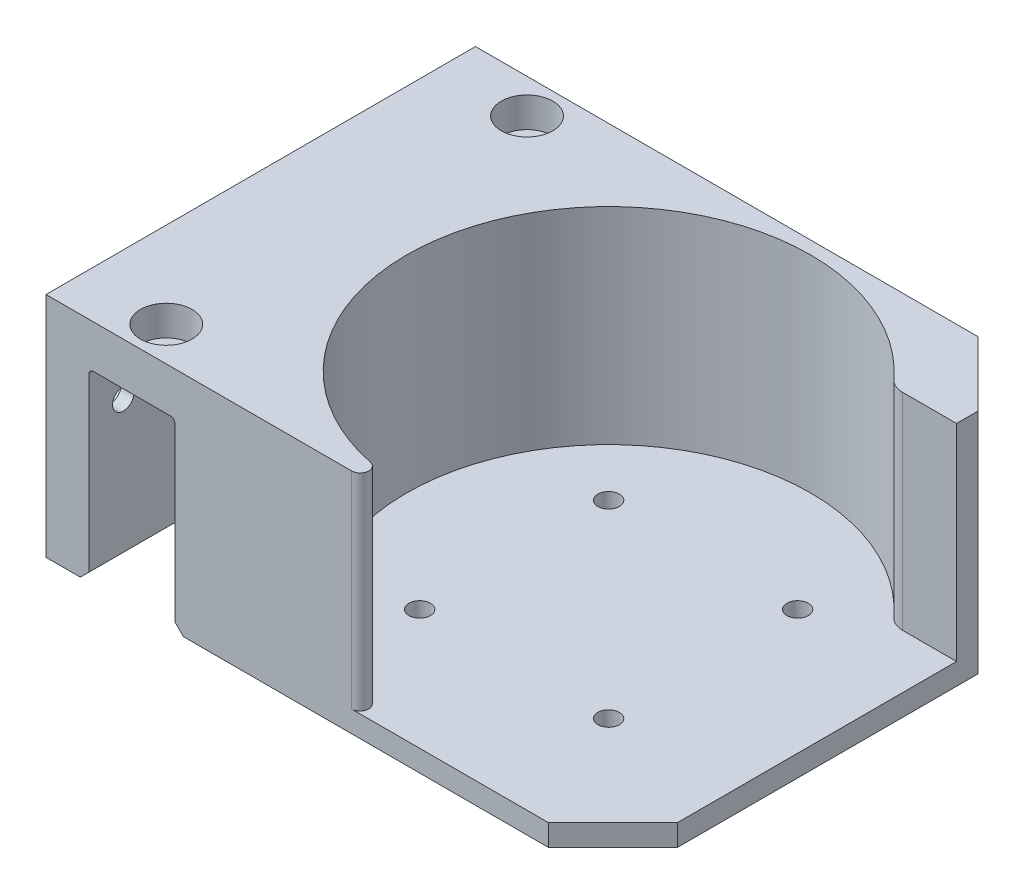
ISO-10303-21;
HEADER;
FILE_DESCRIPTION(('STEP AP214'),'2;1');
FILE_NAME('part.step','',(''),(''),'','','');
FILE_SCHEMA(('AUTOMOTIVE_DESIGN { 1 0 10303 214 1 1 1 1 }'));
ENDSEC;
DATA;
#1=APPLICATION_CONTEXT('core data for automotive mechanical design processes');
#2=APPLICATION_PROTOCOL_DEFINITION('international standard','automotive_design',2000,#1);
#3=PRODUCT_CONTEXT('',#1,'mechanical');
#4=PRODUCT('Part','Part','',(#3));
#5=PRODUCT_RELATED_PRODUCT_CATEGORY('part','',(#4));
#6=PRODUCT_DEFINITION_FORMATION('','',#4);
#7=PRODUCT_DEFINITION_CONTEXT('part definition',#1,'design');
#8=PRODUCT_DEFINITION('design','',#6,#7);
#9=PRODUCT_DEFINITION_SHAPE('','',#8);
#10=(LENGTH_UNIT() NAMED_UNIT(*) SI_UNIT(.MILLI.,.METRE.));
#11=(NAMED_UNIT(*) PLANE_ANGLE_UNIT() SI_UNIT($,.RADIAN.));
#12=(NAMED_UNIT(*) SI_UNIT($,.STERADIAN.) SOLID_ANGLE_UNIT());
#13=UNCERTAINTY_MEASURE_WITH_UNIT(LENGTH_MEASURE(1.E-05),#10,'distance_accuracy_value','');
#14=(GEOMETRIC_REPRESENTATION_CONTEXT(3) GLOBAL_UNCERTAINTY_ASSIGNED_CONTEXT((#13)) GLOBAL_UNIT_ASSIGNED_CONTEXT((#10,
#11,#12)) REPRESENTATION_CONTEXT('',''));
#15=CARTESIAN_POINT('',(0.,0.,0.));
#16=DIRECTION('',(0.,0.,1.));
#17=DIRECTION('',(1.,0.,0.));
#18=AXIS2_PLACEMENT_3D('',#15,#16,#17);
#19=CARTESIAN_POINT('',(-101.,33.,-42.));
#20=DIRECTION('',(1.,0.,0.));
#21=DIRECTION('',(0.,0.,-1.));
#22=AXIS2_PLACEMENT_3D('',#19,#20,#21);
#23=CYLINDRICAL_SURFACE('',#22,2.5);
#24=CARTESIAN_POINT('',(-71.,33.,-42.));
#25=DIRECTION('',(1.,0.,0.));
#26=DIRECTION('',(0.,0.,-1.));
#27=AXIS2_PLACEMENT_3D('',#24,#25,#26);
#28=CIRCLE('',#27,2.5);
#29=CARTESIAN_POINT('',(-71.,33.,-44.5));
#30=VERTEX_POINT('',#29);
#31=EDGE_CURVE('E382',#30,#30,#28,.T.);
#32=ORIENTED_EDGE('',*,*,#31,.T.);
#33=EDGE_LOOP('',(#32));
#34=FACE_BOUND('',#33,.T.);
#35=CARTESIAN_POINT('',(-74.,33.,-42.));
#36=DIRECTION('',(-1.,0.,0.));
#37=DIRECTION('',(0.,0.,1.));
#38=AXIS2_PLACEMENT_3D('',#35,#36,#37);
#39=CIRCLE('',#38,2.5);
#40=CARTESIAN_POINT('',(-74.,33.,-39.5));
#41=VERTEX_POINT('',#40);
#42=EDGE_CURVE('E377',#41,#41,#39,.F.);
#43=ORIENTED_EDGE('',*,*,#42,.F.);
#44=EDGE_LOOP('',(#43));
#45=FACE_BOUND('',#44,.T.);
#46=ADVANCED_FACE('F39',(#34,#45),#23,.F.);
#47=CARTESIAN_POINT('',(-101.,33.,42.));
#48=DIRECTION('',(1.,0.,0.));
#49=DIRECTION('',(0.,0.,-1.));
#50=AXIS2_PLACEMENT_3D('',#47,#48,#49);
#51=CYLINDRICAL_SURFACE('',#50,2.5);
#52=CARTESIAN_POINT('',(-71.,33.,42.));
#53=DIRECTION('',(1.,0.,0.));
#54=DIRECTION('',(0.,0.,-1.));
#55=AXIS2_PLACEMENT_3D('',#52,#53,#54);
#56=CIRCLE('',#55,2.5);
#57=CARTESIAN_POINT('',(-71.,33.,39.5));
#58=VERTEX_POINT('',#57);
#59=EDGE_CURVE('E867',#58,#58,#56,.T.);
#60=ORIENTED_EDGE('',*,*,#59,.T.);
#61=EDGE_LOOP('',(#60));
#62=FACE_BOUND('',#61,.T.);
#63=CARTESIAN_POINT('',(-74.,33.,42.));
#64=DIRECTION('',(-1.,0.,0.));
#65=DIRECTION('',(0.,0.,1.));
#66=AXIS2_PLACEMENT_3D('',#63,#64,#65);
#67=CIRCLE('',#66,2.5);
#68=CARTESIAN_POINT('',(-74.,33.,44.5));
#69=VERTEX_POINT('',#68);
#70=EDGE_CURVE('E373',#69,#69,#67,.F.);
#71=ORIENTED_EDGE('',*,*,#70,.F.);
#72=EDGE_LOOP('',(#71));
#73=FACE_BOUND('',#72,.T.);
#74=ADVANCED_FACE('F504',(#62,#73),#51,.F.);
#75=CARTESIAN_POINT('',(-61.,73.,-42.));
#76=DIRECTION('',(0.,-1.,0.));
#77=DIRECTION('',(0.,0.,-1.));
#78=AXIS2_PLACEMENT_3D('',#75,#76,#77);
#79=CYLINDRICAL_SURFACE('',#78,2.5);
#80=CARTESIAN_POINT('',(-61.,43.,-42.));
#81=DIRECTION('',(0.,-1.,0.));
#82=DIRECTION('',(0.,0.,-1.));
#83=AXIS2_PLACEMENT_3D('',#80,#81,#82);
#84=CIRCLE('',#83,2.5);
#85=CARTESIAN_POINT('',(-61.,43.,-44.5));
#86=VERTEX_POINT('',#85);
#87=EDGE_CURVE('E372',#86,#86,#84,.T.);
#88=ORIENTED_EDGE('',*,*,#87,.T.);
#89=EDGE_LOOP('',(#88));
#90=FACE_BOUND('',#89,.T.);
#91=CARTESIAN_POINT('',(-61.,46.,-42.));
#92=DIRECTION('',(0.,1.,0.));
#93=DIRECTION('',(0.,0.,1.));
#94=AXIS2_PLACEMENT_3D('',#91,#92,#93);
#95=CIRCLE('',#94,2.5);
#96=CARTESIAN_POINT('',(-61.,46.,-39.5));
#97=VERTEX_POINT('',#96);
#98=EDGE_CURVE('E367',#97,#97,#95,.F.);
#99=ORIENTED_EDGE('',*,*,#98,.F.);
#100=EDGE_LOOP('',(#99));
#101=FACE_BOUND('',#100,.T.);
#102=ADVANCED_FACE('F510',(#90,#101),#79,.F.);
#103=CARTESIAN_POINT('',(-61.,73.,42.));
#104=DIRECTION('',(0.,-1.,0.));
#105=DIRECTION('',(0.,0.,-1.));
#106=AXIS2_PLACEMENT_3D('',#103,#104,#105);
#107=CYLINDRICAL_SURFACE('',#106,2.5);
#108=CARTESIAN_POINT('',(-61.,43.,42.));
#109=DIRECTION('',(0.,-1.,0.));
#110=DIRECTION('',(0.,0.,-1.));
#111=AXIS2_PLACEMENT_3D('',#108,#109,#110);
#112=CIRCLE('',#111,2.5);
#113=CARTESIAN_POINT('',(-61.,43.,39.5));
#114=VERTEX_POINT('',#113);
#115=EDGE_CURVE('E205',#114,#114,#112,.T.);
#116=ORIENTED_EDGE('',*,*,#115,.T.);
#117=EDGE_LOOP('',(#116));
#118=FACE_BOUND('',#117,.T.);
#119=CARTESIAN_POINT('',(-61.,46.,42.));
#120=DIRECTION('',(0.,1.,0.));
#121=DIRECTION('',(0.,0.,1.));
#122=AXIS2_PLACEMENT_3D('',#119,#120,#121);
#123=CIRCLE('',#122,2.5);
#124=CARTESIAN_POINT('',(-61.,46.,44.5));
#125=VERTEX_POINT('',#124);
#126=EDGE_CURVE('E363',#125,#125,#123,.F.);
#127=ORIENTED_EDGE('',*,*,#126,.F.);
#128=EDGE_LOOP('',(#127));
#129=FACE_BOUND('',#128,.T.);
#130=ADVANCED_FACE('F534',(#118,#129),#107,.F.);
#131=CARTESIAN_POINT('',(-81.,43.,-50.));
#132=DIRECTION('',(0.,1.,0.));
#133=DIRECTION('',(0.,0.,1.));
#134=AXIS2_PLACEMENT_3D('',#131,#132,#133);
#135=PLANE('',#134);
#136=ORIENTED_EDGE('',*,*,#115,.F.);
#137=EDGE_LOOP('',(#136));
#138=FACE_BOUND('',#137,.T.);
#139=ORIENTED_EDGE('',*,*,#87,.F.);
#140=EDGE_LOOP('',(#139));
#141=FACE_BOUND('',#140,.T.);
#142=DIRECTION('',(1.,0.,0.));
#143=VECTOR('',#142,1.);
#144=CARTESIAN_POINT('',(-81.,43.,50.));
#145=LINE('',#144,#143);
#146=CARTESIAN_POINT('',(-70.,43.,50.));
#147=VERTEX_POINT('',#146);
#148=CARTESIAN_POINT('',(-52.,43.,50.));
#149=VERTEX_POINT('',#148);
#150=EDGE_CURVE('E215',#147,#149,#145,.T.);
#151=ORIENTED_EDGE('',*,*,#150,.F.);
#152=DIRECTION('',(0.,0.,1.));
#153=VECTOR('',#152,1.);
#154=CARTESIAN_POINT('',(-70.,43.,-50.));
#155=LINE('',#154,#153);
#156=CARTESIAN_POINT('',(-70.,43.,-50.));
#157=VERTEX_POINT('',#156);
#158=EDGE_CURVE('E416',#147,#157,#155,.F.);
#159=ORIENTED_EDGE('',*,*,#158,.T.);
#160=DIRECTION('',(1.,0.,0.));
#161=VECTOR('',#160,1.);
#162=CARTESIAN_POINT('',(-81.,43.,-50.));
#163=LINE('',#162,#161);
#164=CARTESIAN_POINT('',(-52.,43.,-50.));
#165=VERTEX_POINT('',#164);
#166=EDGE_CURVE('E218',#157,#165,#163,.T.);
#167=ORIENTED_EDGE('',*,*,#166,.T.);
#168=DIRECTION('',(0.,0.,1.));
#169=VECTOR('',#168,1.);
#170=CARTESIAN_POINT('',(-52.,43.,50.));
#171=LINE('',#170,#169);
#172=EDGE_CURVE('E412',#165,#149,#171,.T.);
#173=ORIENTED_EDGE('',*,*,#172,.T.);
#174=EDGE_LOOP('',(#151,#159,#167,#173));
#175=FACE_BOUND('',#174,.T.);
#176=ADVANCED_FACE('F440',(#138,#141,#175),#135,.F.);
#177=CARTESIAN_POINT('',(-51.,53.,-50.));
#178=DIRECTION('',(1.,0.,0.));
#179=DIRECTION('',(0.,0.,-1.));
#180=AXIS2_PLACEMENT_3D('',#177,#178,#179);
#181=PLANE('',#180);
#182=DIRECTION('',(0.,-1.,0.));
#183=VECTOR('',#182,1.);
#184=CARTESIAN_POINT('',(-51.,53.,50.));
#185=LINE('',#184,#183);
#186=CARTESIAN_POINT('',(-51.,42.,50.));
#187=VERTEX_POINT('',#186);
#188=CARTESIAN_POINT('',(-51.,2.00000000000002,50.));
#189=VERTEX_POINT('',#188);
#190=EDGE_CURVE('E293',#187,#189,#185,.T.);
#191=ORIENTED_EDGE('',*,*,#190,.F.);
#192=DIRECTION('',(0.,0.,1.));
#193=VECTOR('',#192,1.);
#194=CARTESIAN_POINT('',(-51.,42.,-50.));
#195=LINE('',#194,#193);
#196=CARTESIAN_POINT('',(-51.,42.,-50.));
#197=VERTEX_POINT('',#196);
#198=EDGE_CURVE('E61',#187,#197,#195,.F.);
#199=ORIENTED_EDGE('',*,*,#198,.T.);
#200=DIRECTION('',(0.,-1.,0.));
#201=VECTOR('',#200,1.);
#202=CARTESIAN_POINT('',(-51.,53.,-50.));
#203=LINE('',#202,#201);
#204=CARTESIAN_POINT('',(-51.,2.00000000000002,-50.));
#205=VERTEX_POINT('',#204);
#206=EDGE_CURVE('E305',#197,#205,#203,.T.);
#207=ORIENTED_EDGE('',*,*,#206,.T.);
#208=DIRECTION('',(0.,0.,1.));
#209=VECTOR('',#208,1.);
#210=CARTESIAN_POINT('',(-51.,2.00000000000002,-50.));
#211=LINE('',#210,#209);
#212=EDGE_CURVE('E401',#205,#189,#211,.T.);
#213=ORIENTED_EDGE('',*,*,#212,.T.);
#214=EDGE_LOOP('',(#191,#199,#207,#213));
#215=FACE_BOUND('',#214,.T.);
#216=ADVANCED_FACE('F446',(#215),#181,.F.);
#217=CARTESIAN_POINT('',(51.,53.,-50.));
#218=DIRECTION('',(-1.,0.,0.));
#219=DIRECTION('',(0.,0.,1.));
#220=AXIS2_PLACEMENT_3D('',#217,#218,#219);
#221=PLANE('',#220);
#222=DIRECTION('',(0.,0.,-1.));
#223=VECTOR('',#222,1.);
#224=CARTESIAN_POINT('',(51.,5.,0.));
#225=LINE('',#224,#223);
#226=CARTESIAN_POINT('',(51.,5.,35.));
#227=VERTEX_POINT('',#226);
#228=CARTESIAN_POINT('',(51.,5.,-30.));
#229=VERTEX_POINT('',#228);
#230=EDGE_CURVE('E263',#227,#229,#225,.T.);
#231=ORIENTED_EDGE('',*,*,#230,.F.);
#232=DIRECTION('',(0.,-1.,0.));
#233=VECTOR('',#232,1.);
#234=CARTESIAN_POINT('',(51.,53.,35.));
#235=LINE('',#234,#233);
#236=CARTESIAN_POINT('',(51.,0.,35.));
#237=VERTEX_POINT('',#236);
#238=EDGE_CURVE('E311',#227,#237,#235,.T.);
#239=ORIENTED_EDGE('',*,*,#238,.T.);
#240=DIRECTION('',(0.,0.,-1.));
#241=VECTOR('',#240,1.);
#242=CARTESIAN_POINT('',(51.,0.,-50.));
#243=LINE('',#242,#241);
#244=CARTESIAN_POINT('',(51.,0.,-35.));
#245=VERTEX_POINT('',#244);
#246=EDGE_CURVE('E280',#237,#245,#243,.T.);
#247=ORIENTED_EDGE('',*,*,#246,.T.);
#248=DIRECTION('',(0.,1.,0.));
#249=VECTOR('',#248,1.);
#250=CARTESIAN_POINT('',(51.,53.,-35.));
#251=LINE('',#250,#249);
#252=CARTESIAN_POINT('',(51.,53.,-35.));
#253=VERTEX_POINT('',#252);
#254=EDGE_CURVE('E308',#245,#253,#251,.T.);
#255=ORIENTED_EDGE('',*,*,#254,.T.);
#256=DIRECTION('',(0.,0.,-1.));
#257=VECTOR('',#256,1.);
#258=CARTESIAN_POINT('',(51.,53.,-50.));
#259=LINE('',#258,#257);
#260=CARTESIAN_POINT('',(51.,53.,-30.));
#261=VERTEX_POINT('',#260);
#262=EDGE_CURVE('E281',#261,#253,#259,.T.);
#263=ORIENTED_EDGE('',*,*,#262,.F.);
#264=DIRECTION('',(0.,1.,0.));
#265=VECTOR('',#264,1.);
#266=CARTESIAN_POINT('',(51.,5.,-30.));
#267=LINE('',#266,#265);
#268=EDGE_CURVE('E271',#229,#261,#267,.T.);
#269=ORIENTED_EDGE('',*,*,#268,.F.);
#270=EDGE_LOOP('',(#231,#239,#247,#255,#263,#269));
#271=FACE_BOUND('',#270,.T.);
#272=ADVANCED_FACE('F479',(#271),#221,.F.);
#273=CARTESIAN_POINT('',(0.,53.,0.));
#274=DIRECTION('',(0.,1.,0.));
#275=DIRECTION('',(0.,0.,1.));
#276=AXIS2_PLACEMENT_3D('',#273,#274,#275);
#277=PLANE('',#276);
#278=CARTESIAN_POINT('',(-61.,53.,-42.));
#279=DIRECTION('',(0.,1.,0.));
#280=DIRECTION('',(0.,0.,1.));
#281=AXIS2_PLACEMENT_3D('',#278,#279,#280);
#282=CIRCLE('',#281,5.99999999999999);
#283=CARTESIAN_POINT('',(-61.,53.,-36.));
#284=VERTEX_POINT('',#283);
#285=EDGE_CURVE('E860',#284,#284,#282,.T.);
#286=ORIENTED_EDGE('',*,*,#285,.F.);
#287=EDGE_LOOP('',(#286));
#288=FACE_BOUND('',#287,.T.);
#289=CARTESIAN_POINT('',(-61.,53.,42.));
#290=DIRECTION('',(0.,1.,0.));
#291=DIRECTION('',(0.,0.,1.));
#292=AXIS2_PLACEMENT_3D('',#289,#290,#291);
#293=CIRCLE('',#292,6.);
#294=CARTESIAN_POINT('',(-61.,53.,48.));
#295=VERTEX_POINT('',#294);
#296=EDGE_CURVE('E863',#295,#295,#293,.T.);
#297=ORIENTED_EDGE('',*,*,#296,.F.);
#298=EDGE_LOOP('',(#297));
#299=FACE_BOUND('',#298,.T.);
#300=DIRECTION('',(1.,0.,0.));
#301=VECTOR('',#300,1.);
#302=CARTESIAN_POINT('',(-51.,53.,50.));
#303=LINE('',#302,#301);
#304=CARTESIAN_POINT('',(-81.,53.,50.));
#305=VERTEX_POINT('',#304);
#306=CARTESIAN_POINT('',(-9.84885780179617,53.,50.));
#307=VERTEX_POINT('',#306);
#308=EDGE_CURVE('E289',#305,#307,#303,.T.);
#309=ORIENTED_EDGE('',*,*,#308,.T.);
#310=CARTESIAN_POINT('',(-9.84885780179621,53.,48.));
#311=DIRECTION('',(0.,1.,0.));
#312=DIRECTION('',(0.,0.,1.));
#313=AXIS2_PLACEMENT_3D('',#310,#311,#312);
#314=CIRCLE('',#313,2.);
#315=CARTESIAN_POINT('',(-9.4468636058045,53.,46.0408163265306));
#316=VERTEX_POINT('',#315);
#317=EDGE_CURVE('E352',#307,#316,#314,.T.);
#318=ORIENTED_EDGE('',*,*,#317,.T.);
#319=CARTESIAN_POINT('',(0.,53.,0.));
#320=DIRECTION('',(0.,1.,0.));
#321=DIRECTION('',(0.,0.,1.));
#322=AXIS2_PLACEMENT_3D('',#319,#320,#321);
#323=CIRCLE('',#322,47.);
#324=CARTESIAN_POINT('',(34.7599066377839,53.,-31.6346153846154));
#325=VERTEX_POINT('',#324);
#326=EDGE_CURVE('E258',#325,#316,#323,.T.);
#327=ORIENTED_EDGE('',*,*,#326,.F.);
#328=CARTESIAN_POINT('',(38.4577690460588,53.,-35.));
#329=DIRECTION('',(0.,1.,0.));
#330=DIRECTION('',(0.,0.,1.));
#331=AXIS2_PLACEMENT_3D('',#328,#329,#330);
#332=CIRCLE('',#331,5.);
#333=CARTESIAN_POINT('',(38.4577690460588,53.,-30.));
#334=VERTEX_POINT('',#333);
#335=EDGE_CURVE('E339',#325,#334,#332,.T.);
#336=ORIENTED_EDGE('',*,*,#335,.T.);
#337=DIRECTION('',(1.,0.,0.));
#338=VECTOR('',#337,1.);
#339=CARTESIAN_POINT('',(0.,53.,-30.));
#340=LINE('',#339,#338);
#341=EDGE_CURVE('E264',#334,#261,#340,.T.);
#342=ORIENTED_EDGE('',*,*,#341,.T.);
#343=ORIENTED_EDGE('',*,*,#262,.T.);
#344=DIRECTION('',(0.707106781186547,0.,0.707106781186549));
#345=VECTOR('',#344,1.);
#346=CARTESIAN_POINT('',(43.,53.,-42.9999999999999));
#347=LINE('',#346,#345);
#348=CARTESIAN_POINT('',(36.,53.,-50.));
#349=VERTEX_POINT('',#348);
#350=EDGE_CURVE('E332',#253,#349,#347,.F.);
#351=ORIENTED_EDGE('',*,*,#350,.T.);
#352=DIRECTION('',(-1.,0.,0.));
#353=VECTOR('',#352,1.);
#354=CARTESIAN_POINT('',(-51.,53.,-50.));
#355=LINE('',#354,#353);
#356=CARTESIAN_POINT('',(-81.,53.,-50.));
#357=VERTEX_POINT('',#356);
#358=EDGE_CURVE('E285',#349,#357,#355,.T.);
#359=ORIENTED_EDGE('',*,*,#358,.T.);
#360=DIRECTION('',(0.,0.,-1.));
#361=VECTOR('',#360,1.);
#362=CARTESIAN_POINT('',(-81.,53.,-50.));
#363=LINE('',#362,#361);
#364=EDGE_CURVE('E189',#305,#357,#363,.T.);
#365=ORIENTED_EDGE('',*,*,#364,.F.);
#366=EDGE_LOOP('',(#309,#318,#327,#336,#342,#343,#351,#359,#365));
#367=FACE_BOUND('',#366,.T.);
#368=ADVANCED_FACE('F471',(#288,#299,#367),#277,.T.);
#369=CARTESIAN_POINT('',(-51.,53.,-50.));
#370=DIRECTION('',(0.,0.,1.));
#371=DIRECTION('',(1.,0.,0.));
#372=AXIS2_PLACEMENT_3D('',#369,#370,#371);
#373=PLANE('',#372);
#374=DIRECTION('',(0.,1.,0.));
#375=VECTOR('',#374,1.);
#376=CARTESIAN_POINT('',(-71.,-100.498756211209,-50.));
#377=LINE('',#376,#375);
#378=CARTESIAN_POINT('',(-71.,2.00000000000002,-50.));
#379=VERTEX_POINT('',#378);
#380=CARTESIAN_POINT('',(-71.,42.,-50.));
#381=VERTEX_POINT('',#380);
#382=EDGE_CURVE('E204',#379,#381,#377,.T.);
#383=ORIENTED_EDGE('',*,*,#382,.F.);
#384=DIRECTION('',(0.707106781186549,0.707106781186546,0.));
#385=VECTOR('',#384,1.);
#386=CARTESIAN_POINT('',(-71.,2.00000000000001,-50.));
#387=LINE('',#386,#385);
#388=CARTESIAN_POINT('',(-73.,0.,-50.));
#389=VERTEX_POINT('',#388);
#390=EDGE_CURVE('E175',#379,#389,#387,.F.);
#391=ORIENTED_EDGE('',*,*,#390,.T.);
#392=DIRECTION('',(-1.,0.,0.));
#393=VECTOR('',#392,1.);
#394=CARTESIAN_POINT('',(-81.,0.,-50.));
#395=LINE('',#394,#393);
#396=CARTESIAN_POINT('',(-81.,0.,-50.));
#397=VERTEX_POINT('',#396);
#398=EDGE_CURVE('E169',#389,#397,#395,.T.);
#399=ORIENTED_EDGE('',*,*,#398,.T.);
#400=DIRECTION('',(0.,-1.,0.));
#401=VECTOR('',#400,1.);
#402=CARTESIAN_POINT('',(-81.,53.,-50.));
#403=LINE('',#402,#401);
#404=EDGE_CURVE('E174',#357,#397,#403,.T.);
#405=ORIENTED_EDGE('',*,*,#404,.F.);
#406=ORIENTED_EDGE('',*,*,#358,.F.);
#407=DIRECTION('',(0.,-1.,0.));
#408=VECTOR('',#407,1.);
#409=CARTESIAN_POINT('',(36.,53.,-50.));
#410=LINE('',#409,#408);
#411=CARTESIAN_POINT('',(36.,0.,-50.));
#412=VERTEX_POINT('',#411);
#413=EDGE_CURVE('E328',#349,#412,#410,.T.);
#414=ORIENTED_EDGE('',*,*,#413,.T.);
#415=DIRECTION('',(-1.,0.,0.));
#416=VECTOR('',#415,1.);
#417=CARTESIAN_POINT('',(-51.,0.,-50.));
#418=LINE('',#417,#416);
#419=CARTESIAN_POINT('',(-49.,0.,-50.));
#420=VERTEX_POINT('',#419);
#421=EDGE_CURVE('E297',#412,#420,#418,.T.);
#422=ORIENTED_EDGE('',*,*,#421,.T.);
#423=DIRECTION('',(0.707106781186548,-0.707106781186548,0.));
#424=VECTOR('',#423,1.);
#425=CARTESIAN_POINT('',(-51.,2.00000000000002,-50.));
#426=LINE('',#425,#424);
#427=EDGE_CURVE('E386',#420,#205,#426,.F.);
#428=ORIENTED_EDGE('',*,*,#427,.T.);
#429=ORIENTED_EDGE('',*,*,#206,.F.);
#430=CARTESIAN_POINT('',(-52.,42.,-50.));
#431=DIRECTION('',(0.,0.,1.));
#432=DIRECTION('',(1.,0.,0.));
#433=AXIS2_PLACEMENT_3D('',#430,#431,#432);
#434=CIRCLE('',#433,1.);
#435=EDGE_CURVE('E11',#197,#165,#434,.T.);
#436=ORIENTED_EDGE('',*,*,#435,.T.);
#437=ORIENTED_EDGE('',*,*,#166,.F.);
#438=CARTESIAN_POINT('',(-70.,42.,-50.));
#439=DIRECTION('',(0.,0.,1.));
#440=DIRECTION('',(1.,0.,0.));
#441=AXIS2_PLACEMENT_3D('',#438,#439,#440);
#442=CIRCLE('',#441,1.);
#443=EDGE_CURVE('E424',#157,#381,#442,.T.);
#444=ORIENTED_EDGE('',*,*,#443,.T.);
#445=EDGE_LOOP('',(#383,#391,#399,#405,#406,#414,#422,#428,#429,#436,#437,#444));
#446=FACE_BOUND('',#445,.T.);
#447=ADVANCED_FACE('F172',(#446),#373,.F.);
#448=CARTESIAN_POINT('',(-51.,53.,50.));
#449=DIRECTION('',(0.,0.,-1.));
#450=DIRECTION('',(-1.,0.,0.));
#451=AXIS2_PLACEMENT_3D('',#448,#449,#450);
#452=PLANE('',#451);
#453=DIRECTION('',(1.,0.,0.));
#454=VECTOR('',#453,1.);
#455=CARTESIAN_POINT('',(-81.,0.,50.));
#456=LINE('',#455,#454);
#457=CARTESIAN_POINT('',(-81.,0.,50.));
#458=VERTEX_POINT('',#457);
#459=CARTESIAN_POINT('',(-73.0000000000001,0.,50.));
#460=VERTEX_POINT('',#459);
#461=EDGE_CURVE('E181',#458,#460,#456,.T.);
#462=ORIENTED_EDGE('',*,*,#461,.T.);
#463=DIRECTION('',(-0.707106781186549,-0.707106781186546,0.));
#464=VECTOR('',#463,1.);
#465=CARTESIAN_POINT('',(-71.,2.00000000000002,50.));
#466=LINE('',#465,#464);
#467=CARTESIAN_POINT('',(-71.,2.00000000000002,50.));
#468=VERTEX_POINT('',#467);
#469=EDGE_CURVE('E398',#460,#468,#466,.F.);
#470=ORIENTED_EDGE('',*,*,#469,.T.);
#471=DIRECTION('',(0.,1.,0.));
#472=VECTOR('',#471,1.);
#473=CARTESIAN_POINT('',(-71.,-100.498756211209,50.));
#474=LINE('',#473,#472);
#475=CARTESIAN_POINT('',(-71.,42.,50.));
#476=VERTEX_POINT('',#475);
#477=EDGE_CURVE('E200',#468,#476,#474,.T.);
#478=ORIENTED_EDGE('',*,*,#477,.T.);
#479=CARTESIAN_POINT('',(-70.,42.,50.));
#480=DIRECTION('',(0.,0.,-1.));
#481=DIRECTION('',(-1.,0.,0.));
#482=AXIS2_PLACEMENT_3D('',#479,#480,#481);
#483=CIRCLE('',#482,1.);
#484=EDGE_CURVE('E421',#476,#147,#483,.T.);
#485=ORIENTED_EDGE('',*,*,#484,.T.);
#486=ORIENTED_EDGE('',*,*,#150,.T.);
#487=CARTESIAN_POINT('',(-52.,42.,50.));
#488=DIRECTION('',(0.,0.,-1.));
#489=DIRECTION('',(-1.,0.,0.));
#490=AXIS2_PLACEMENT_3D('',#487,#488,#489);
#491=CIRCLE('',#490,1.);
#492=EDGE_CURVE('E48',#149,#187,#491,.T.);
#493=ORIENTED_EDGE('',*,*,#492,.T.);
#494=ORIENTED_EDGE('',*,*,#190,.T.);
#495=DIRECTION('',(-0.707106781186548,0.707106781186548,0.));
#496=VECTOR('',#495,1.);
#497=CARTESIAN_POINT('',(-51.,2.00000000000002,50.));
#498=LINE('',#497,#496);
#499=CARTESIAN_POINT('',(-49.,0.,50.));
#500=VERTEX_POINT('',#499);
#501=EDGE_CURVE('E395',#189,#500,#498,.F.);
#502=ORIENTED_EDGE('',*,*,#501,.T.);
#503=DIRECTION('',(1.,0.,0.));
#504=VECTOR('',#503,1.);
#505=CARTESIAN_POINT('',(-51.,0.,50.));
#506=LINE('',#505,#504);
#507=CARTESIAN_POINT('',(35.9999999999999,0.,50.));
#508=VERTEX_POINT('',#507);
#509=EDGE_CURVE('E286',#500,#508,#506,.T.);
#510=ORIENTED_EDGE('',*,*,#509,.T.);
#511=DIRECTION('',(0.,1.,0.));
#512=VECTOR('',#511,1.);
#513=CARTESIAN_POINT('',(35.9999999999999,53.,50.));
#514=LINE('',#513,#512);
#515=CARTESIAN_POINT('',(35.9999999999999,5.,50.));
#516=VERTEX_POINT('',#515);
#517=EDGE_CURVE('E322',#508,#516,#514,.T.);
#518=ORIENTED_EDGE('',*,*,#517,.T.);
#519=DIRECTION('',(1.,0.,0.));
#520=VECTOR('',#519,1.);
#521=CARTESIAN_POINT('',(0.,5.,50.));
#522=LINE('',#521,#520);
#523=CARTESIAN_POINT('',(-9.84885780179621,5.,50.));
#524=VERTEX_POINT('',#523);
#525=EDGE_CURVE('E254',#524,#516,#522,.T.);
#526=ORIENTED_EDGE('',*,*,#525,.F.);
#527=DIRECTION('',(0.,1.,0.));
#528=VECTOR('',#527,1.);
#529=CARTESIAN_POINT('',(-9.84885780179621,53.,50.));
#530=LINE('',#529,#528);
#531=EDGE_CURVE('E348',#524,#307,#530,.T.);
#532=ORIENTED_EDGE('',*,*,#531,.T.);
#533=ORIENTED_EDGE('',*,*,#308,.F.);
#534=DIRECTION('',(0.,1.,0.));
#535=VECTOR('',#534,1.);
#536=CARTESIAN_POINT('',(-81.,53.,50.));
#537=LINE('',#536,#535);
#538=EDGE_CURVE('E191',#458,#305,#537,.T.);
#539=ORIENTED_EDGE('',*,*,#538,.F.);
#540=EDGE_LOOP('',(#462,#470,#478,#485,#486,#493,#494,#502,#510,#518,#526,#532,#533,#539));
#541=FACE_BOUND('',#540,.T.);
#542=ADVANCED_FACE('F438',(#541),#452,.F.);
#543=CARTESIAN_POINT('',(0.,0.,0.));
#544=DIRECTION('',(0.,1.,0.));
#545=DIRECTION('',(0.,0.,1.));
#546=AXIS2_PLACEMENT_3D('',#543,#544,#545);
#547=PLANE('',#546);
#548=CARTESIAN_POINT('',(22.,0.,22.));
#549=DIRECTION('',(0.,1.,0.));
#550=DIRECTION('',(0.,0.,1.));
#551=AXIS2_PLACEMENT_3D('',#548,#549,#550);
#552=CIRCLE('',#551,2.5);
#553=CARTESIAN_POINT('',(22.,0.,24.5));
#554=VERTEX_POINT('',#553);
#555=EDGE_CURVE('E250',#554,#554,#552,.T.);
#556=ORIENTED_EDGE('',*,*,#555,.T.);
#557=EDGE_LOOP('',(#556));
#558=FACE_BOUND('',#557,.T.);
#559=CARTESIAN_POINT('',(-22.,0.,22.));
#560=DIRECTION('',(0.,1.,0.));
#561=DIRECTION('',(0.,0.,1.));
#562=AXIS2_PLACEMENT_3D('',#559,#560,#561);
#563=CIRCLE('',#562,2.5);
#564=CARTESIAN_POINT('',(-22.,0.,24.5));
#565=VERTEX_POINT('',#564);
#566=EDGE_CURVE('E246',#565,#565,#563,.T.);
#567=ORIENTED_EDGE('',*,*,#566,.T.);
#568=EDGE_LOOP('',(#567));
#569=FACE_BOUND('',#568,.T.);
#570=CARTESIAN_POINT('',(-22.,0.,-22.));
#571=DIRECTION('',(0.,1.,0.));
#572=DIRECTION('',(0.,0.,1.));
#573=AXIS2_PLACEMENT_3D('',#570,#571,#572);
#574=CIRCLE('',#573,2.5);
#575=CARTESIAN_POINT('',(-22.,0.,-19.5));
#576=VERTEX_POINT('',#575);
#577=EDGE_CURVE('E242',#576,#576,#574,.T.);
#578=ORIENTED_EDGE('',*,*,#577,.T.);
#579=EDGE_LOOP('',(#578));
#580=FACE_BOUND('',#579,.T.);
#581=CARTESIAN_POINT('',(22.,0.,-22.));
#582=DIRECTION('',(0.,1.,0.));
#583=DIRECTION('',(0.,0.,1.));
#584=AXIS2_PLACEMENT_3D('',#581,#582,#583);
#585=CIRCLE('',#584,2.5);
#586=CARTESIAN_POINT('',(22.,0.,-19.5));
#587=VERTEX_POINT('',#586);
#588=EDGE_CURVE('E238',#587,#587,#585,.T.);
#589=ORIENTED_EDGE('',*,*,#588,.T.);
#590=EDGE_LOOP('',(#589));
#591=FACE_BOUND('',#590,.T.);
#592=ORIENTED_EDGE('',*,*,#509,.F.);
#593=DIRECTION('',(0.,0.,-1.));
#594=VECTOR('',#593,1.);
#595=CARTESIAN_POINT('',(-49.,0.,0.));
#596=LINE('',#595,#594);
#597=EDGE_CURVE('E405',#500,#420,#596,.T.);
#598=ORIENTED_EDGE('',*,*,#597,.T.);
#599=ORIENTED_EDGE('',*,*,#421,.F.);
#600=DIRECTION('',(-0.707106781186547,0.,-0.707106781186549));
#601=VECTOR('',#600,1.);
#602=CARTESIAN_POINT('',(36.,0.,-50.));
#603=LINE('',#602,#601);
#604=EDGE_CURVE('E315',#412,#245,#603,.F.);
#605=ORIENTED_EDGE('',*,*,#604,.T.);
#606=ORIENTED_EDGE('',*,*,#246,.F.);
#607=DIRECTION('',(0.707106781186549,0.,-0.707106781186546));
#608=VECTOR('',#607,1.);
#609=CARTESIAN_POINT('',(51.,0.,35.));
#610=LINE('',#609,#608);
#611=EDGE_CURVE('E318',#237,#508,#610,.F.);
#612=ORIENTED_EDGE('',*,*,#611,.T.);
#613=EDGE_LOOP('',(#592,#598,#599,#605,#606,#612));
#614=FACE_BOUND('',#613,.T.);
#615=ADVANCED_FACE('F453',(#558,#569,#580,#591,#614),#547,.F.);
#616=CARTESIAN_POINT('',(0.,5.,0.));
#617=DIRECTION('',(0.,1.,0.));
#618=DIRECTION('',(0.,0.,1.));
#619=AXIS2_PLACEMENT_3D('',#616,#617,#618);
#620=CYLINDRICAL_SURFACE('',#619,47.);
#621=ORIENTED_EDGE('',*,*,#326,.T.);
#622=DIRECTION('',(0.,1.,0.));
#623=VECTOR('',#622,1.);
#624=CARTESIAN_POINT('',(-9.44686360580453,5.,46.0408163265306));
#625=LINE('',#624,#623);
#626=CARTESIAN_POINT('',(-9.4468636058045,5.,46.0408163265306));
#627=VERTEX_POINT('',#626);
#628=EDGE_CURVE('E355',#316,#627,#625,.F.);
#629=ORIENTED_EDGE('',*,*,#628,.T.);
#630=CARTESIAN_POINT('',(0.,5.,0.));
#631=DIRECTION('',(0.,1.,0.));
#632=DIRECTION('',(0.,0.,1.));
#633=AXIS2_PLACEMENT_3D('',#630,#631,#632);
#634=CIRCLE('',#633,47.);
#635=CARTESIAN_POINT('',(34.7599066377839,5.,-31.6346153846154));
#636=VERTEX_POINT('',#635);
#637=EDGE_CURVE('E259',#636,#627,#634,.T.);
#638=ORIENTED_EDGE('',*,*,#637,.F.);
#639=DIRECTION('',(0.,1.,0.));
#640=VECTOR('',#639,1.);
#641=CARTESIAN_POINT('',(34.7599066377839,5.,-31.6346153846154));
#642=LINE('',#641,#640);
#643=EDGE_CURVE('E335',#636,#325,#642,.T.);
#644=ORIENTED_EDGE('',*,*,#643,.T.);
#645=EDGE_LOOP('',(#621,#629,#638,#644));
#646=FACE_BOUND('',#645,.T.);
#647=ADVANCED_FACE('F490',(#646),#620,.F.);
#648=CARTESIAN_POINT('',(0.,5.,-30.));
#649=DIRECTION('',(0.,0.,1.));
#650=DIRECTION('',(1.,0.,0.));
#651=AXIS2_PLACEMENT_3D('',#648,#649,#650);
#652=PLANE('',#651);
#653=ORIENTED_EDGE('',*,*,#341,.F.);
#654=DIRECTION('',(0.,-1.,0.));
#655=VECTOR('',#654,1.);
#656=CARTESIAN_POINT('',(38.4577690460588,5.,-30.));
#657=LINE('',#656,#655);
#658=CARTESIAN_POINT('',(38.4577690460588,5.,-30.));
#659=VERTEX_POINT('',#658);
#660=EDGE_CURVE('E342',#334,#659,#657,.T.);
#661=ORIENTED_EDGE('',*,*,#660,.T.);
#662=DIRECTION('',(1.,0.,0.));
#663=VECTOR('',#662,1.);
#664=CARTESIAN_POINT('',(0.,5.,-30.));
#665=LINE('',#664,#663);
#666=EDGE_CURVE('E268',#659,#229,#665,.T.);
#667=ORIENTED_EDGE('',*,*,#666,.T.);
#668=ORIENTED_EDGE('',*,*,#268,.T.);
#669=EDGE_LOOP('',(#653,#661,#667,#668));
#670=FACE_BOUND('',#669,.T.);
#671=ADVANCED_FACE('F492',(#670),#652,.T.);
#672=CARTESIAN_POINT('',(0.,5.,0.));
#673=DIRECTION('',(0.,1.,0.));
#674=DIRECTION('',(0.,0.,1.));
#675=AXIS2_PLACEMENT_3D('',#672,#673,#674);
#676=PLANE('',#675);
#677=CARTESIAN_POINT('',(22.,5.,22.));
#678=DIRECTION('',(0.,1.,0.));
#679=DIRECTION('',(0.,0.,1.));
#680=AXIS2_PLACEMENT_3D('',#677,#678,#679);
#681=CIRCLE('',#680,2.5);
#682=CARTESIAN_POINT('',(22.,5.,24.5));
#683=VERTEX_POINT('',#682);
#684=EDGE_CURVE('E222',#683,#683,#681,.T.);
#685=ORIENTED_EDGE('',*,*,#684,.F.);
#686=EDGE_LOOP('',(#685));
#687=FACE_BOUND('',#686,.T.);
#688=CARTESIAN_POINT('',(-22.,5.,22.));
#689=DIRECTION('',(0.,1.,0.));
#690=DIRECTION('',(0.,0.,1.));
#691=AXIS2_PLACEMENT_3D('',#688,#689,#690);
#692=CIRCLE('',#691,2.5);
#693=CARTESIAN_POINT('',(-22.,5.,24.5));
#694=VERTEX_POINT('',#693);
#695=EDGE_CURVE('E228',#694,#694,#692,.T.);
#696=ORIENTED_EDGE('',*,*,#695,.F.);
#697=EDGE_LOOP('',(#696));
#698=FACE_BOUND('',#697,.T.);
#699=CARTESIAN_POINT('',(-22.,5.,-22.));
#700=DIRECTION('',(0.,1.,0.));
#701=DIRECTION('',(0.,0.,1.));
#702=AXIS2_PLACEMENT_3D('',#699,#700,#701);
#703=CIRCLE('',#702,2.5);
#704=CARTESIAN_POINT('',(-22.,5.,-19.5));
#705=VERTEX_POINT('',#704);
#706=EDGE_CURVE('E223',#705,#705,#703,.T.);
#707=ORIENTED_EDGE('',*,*,#706,.F.);
#708=EDGE_LOOP('',(#707));
#709=FACE_BOUND('',#708,.T.);
#710=CARTESIAN_POINT('',(22.,5.,-22.));
#711=DIRECTION('',(0.,1.,0.));
#712=DIRECTION('',(0.,0.,1.));
#713=AXIS2_PLACEMENT_3D('',#710,#711,#712);
#714=CIRCLE('',#713,2.5);
#715=CARTESIAN_POINT('',(22.,5.,-19.5));
#716=VERTEX_POINT('',#715);
#717=EDGE_CURVE('E227',#716,#716,#714,.T.);
#718=ORIENTED_EDGE('',*,*,#717,.F.);
#719=EDGE_LOOP('',(#718));
#720=FACE_BOUND('',#719,.T.);
#721=ORIENTED_EDGE('',*,*,#525,.T.);
#722=DIRECTION('',(-0.707106781186549,0.,0.707106781186546));
#723=VECTOR('',#722,1.);
#724=CARTESIAN_POINT('',(42.9999999999999,5.,43.));
#725=LINE('',#724,#723);
#726=EDGE_CURVE('E325',#516,#227,#725,.F.);
#727=ORIENTED_EDGE('',*,*,#726,.T.);
#728=ORIENTED_EDGE('',*,*,#230,.T.);
#729=ORIENTED_EDGE('',*,*,#666,.F.);
#730=CARTESIAN_POINT('',(38.4577690460588,5.,-35.));
#731=DIRECTION('',(0.,1.,0.));
#732=DIRECTION('',(0.,0.,1.));
#733=AXIS2_PLACEMENT_3D('',#730,#731,#732);
#734=CIRCLE('',#733,5.);
#735=EDGE_CURVE('E345',#659,#636,#734,.F.);
#736=ORIENTED_EDGE('',*,*,#735,.T.);
#737=ORIENTED_EDGE('',*,*,#637,.T.);
#738=CARTESIAN_POINT('',(-9.84885780179621,5.,48.));
#739=DIRECTION('',(0.,1.,0.));
#740=DIRECTION('',(0.,0.,1.));
#741=AXIS2_PLACEMENT_3D('',#738,#739,#740);
#742=CIRCLE('',#741,2.);
#743=EDGE_CURVE('E358',#627,#524,#742,.F.);
#744=ORIENTED_EDGE('',*,*,#743,.T.);
#745=EDGE_LOOP('',(#721,#727,#728,#729,#736,#737,#744));
#746=FACE_BOUND('',#745,.T.);
#747=ADVANCED_FACE('F462',(#687,#698,#709,#720,#746),#676,.T.);
#748=CARTESIAN_POINT('',(22.,-43.,-22.));
#749=DIRECTION('',(0.,1.,0.));
#750=DIRECTION('',(0.,0.,1.));
#751=AXIS2_PLACEMENT_3D('',#748,#749,#750);
#752=CYLINDRICAL_SURFACE('',#751,2.5);
#753=ORIENTED_EDGE('',*,*,#717,.T.);
#754=EDGE_LOOP('',(#753));
#755=FACE_BOUND('',#754,.T.);
#756=ORIENTED_EDGE('',*,*,#588,.F.);
#757=EDGE_LOOP('',(#756));
#758=FACE_BOUND('',#757,.T.);
#759=ADVANCED_FACE('F499',(#755,#758),#752,.F.);
#760=CARTESIAN_POINT('',(-22.,-43.,-22.));
#761=DIRECTION('',(0.,1.,0.));
#762=DIRECTION('',(0.,0.,1.));
#763=AXIS2_PLACEMENT_3D('',#760,#761,#762);
#764=CYLINDRICAL_SURFACE('',#763,2.5);
#765=ORIENTED_EDGE('',*,*,#706,.T.);
#766=EDGE_LOOP('',(#765));
#767=FACE_BOUND('',#766,.T.);
#768=ORIENTED_EDGE('',*,*,#577,.F.);
#769=EDGE_LOOP('',(#768));
#770=FACE_BOUND('',#769,.T.);
#771=ADVANCED_FACE('F552',(#767,#770),#764,.F.);
#772=CARTESIAN_POINT('',(-22.,-43.,22.));
#773=DIRECTION('',(0.,1.,0.));
#774=DIRECTION('',(0.,0.,1.));
#775=AXIS2_PLACEMENT_3D('',#772,#773,#774);
#776=CYLINDRICAL_SURFACE('',#775,2.5);
#777=ORIENTED_EDGE('',*,*,#695,.T.);
#778=EDGE_LOOP('',(#777));
#779=FACE_BOUND('',#778,.T.);
#780=ORIENTED_EDGE('',*,*,#566,.F.);
#781=EDGE_LOOP('',(#780));
#782=FACE_BOUND('',#781,.T.);
#783=ADVANCED_FACE('F555',(#779,#782),#776,.F.);
#784=CARTESIAN_POINT('',(22.,-43.,22.));
#785=DIRECTION('',(0.,1.,0.));
#786=DIRECTION('',(0.,0.,1.));
#787=AXIS2_PLACEMENT_3D('',#784,#785,#786);
#788=CYLINDRICAL_SURFACE('',#787,2.5);
#789=ORIENTED_EDGE('',*,*,#684,.T.);
#790=EDGE_LOOP('',(#789));
#791=FACE_BOUND('',#790,.T.);
#792=ORIENTED_EDGE('',*,*,#555,.F.);
#793=EDGE_LOOP('',(#792));
#794=FACE_BOUND('',#793,.T.);
#795=ADVANCED_FACE('F559',(#791,#794),#788,.F.);
#796=CARTESIAN_POINT('',(51.,53.,35.));
#797=DIRECTION('',(-0.707106781186546,0.,-0.707106781186549));
#798=DIRECTION('',(0.,-1.,0.));
#799=AXIS2_PLACEMENT_3D('',#796,#797,#798);
#800=PLANE('',#799);
#801=ORIENTED_EDGE('',*,*,#726,.F.);
#802=ORIENTED_EDGE('',*,*,#517,.F.);
#803=ORIENTED_EDGE('',*,*,#611,.F.);
#804=ORIENTED_EDGE('',*,*,#238,.F.);
#805=EDGE_LOOP('',(#801,#802,#803,#804));
#806=FACE_BOUND('',#805,.T.);
#807=ADVANCED_FACE('F460',(#806),#800,.F.);
#808=CARTESIAN_POINT('',(36.,53.,-50.));
#809=DIRECTION('',(-0.707106781186549,0.,0.707106781186547));
#810=DIRECTION('',(0.,-1.,0.));
#811=AXIS2_PLACEMENT_3D('',#808,#809,#810);
#812=PLANE('',#811);
#813=ORIENTED_EDGE('',*,*,#350,.F.);
#814=ORIENTED_EDGE('',*,*,#254,.F.);
#815=ORIENTED_EDGE('',*,*,#604,.F.);
#816=ORIENTED_EDGE('',*,*,#413,.F.);
#817=EDGE_LOOP('',(#813,#814,#815,#816));
#818=FACE_BOUND('',#817,.T.);
#819=ADVANCED_FACE('F476',(#818),#812,.F.);
#820=CARTESIAN_POINT('',(38.4577690460588,5.,-35.));
#821=DIRECTION('',(0.,1.,0.));
#822=DIRECTION('',(0.,0.,1.));
#823=AXIS2_PLACEMENT_3D('',#820,#821,#822);
#824=CYLINDRICAL_SURFACE('',#823,5.);
#825=ORIENTED_EDGE('',*,*,#735,.F.);
#826=ORIENTED_EDGE('',*,*,#660,.F.);
#827=ORIENTED_EDGE('',*,*,#335,.F.);
#828=ORIENTED_EDGE('',*,*,#643,.F.);
#829=EDGE_LOOP('',(#825,#826,#827,#828));
#830=FACE_BOUND('',#829,.T.);
#831=ADVANCED_FACE('F488',(#830),#824,.T.);
#832=CARTESIAN_POINT('',(-81.,0.,0.));
#833=DIRECTION('',(-1.,0.,0.));
#834=DIRECTION('',(0.,0.,1.));
#835=AXIS2_PLACEMENT_3D('',#832,#833,#834);
#836=PLANE('',#835);
#837=CARTESIAN_POINT('',(-81.,33.,-42.));
#838=DIRECTION('',(-1.,0.,0.));
#839=DIRECTION('',(0.,0.,1.));
#840=AXIS2_PLACEMENT_3D('',#837,#838,#839);
#841=CIRCLE('',#840,5.99999999999999);
#842=CARTESIAN_POINT('',(-81.,33.,-36.));
#843=VERTEX_POINT('',#842);
#844=EDGE_CURVE('E902',#843,#843,#841,.T.);
#845=ORIENTED_EDGE('',*,*,#844,.F.);
#846=EDGE_LOOP('',(#845));
#847=FACE_BOUND('',#846,.T.);
#848=CARTESIAN_POINT('',(-81.,33.,42.));
#849=DIRECTION('',(-1.,0.,0.));
#850=DIRECTION('',(0.,0.,1.));
#851=AXIS2_PLACEMENT_3D('',#848,#849,#850);
#852=CIRCLE('',#851,5.99999999999999);
#853=CARTESIAN_POINT('',(-81.,33.,48.));
#854=VERTEX_POINT('',#853);
#855=EDGE_CURVE('E894',#854,#854,#852,.T.);
#856=ORIENTED_EDGE('',*,*,#855,.F.);
#857=EDGE_LOOP('',(#856));
#858=FACE_BOUND('',#857,.T.);
#859=ORIENTED_EDGE('',*,*,#404,.T.);
#860=DIRECTION('',(0.,0.,1.));
#861=VECTOR('',#860,1.);
#862=CARTESIAN_POINT('',(-81.,0.,50.));
#863=LINE('',#862,#861);
#864=EDGE_CURVE('E180',#397,#458,#863,.T.);
#865=ORIENTED_EDGE('',*,*,#864,.T.);
#866=ORIENTED_EDGE('',*,*,#538,.T.);
#867=ORIENTED_EDGE('',*,*,#364,.T.);
#868=EDGE_LOOP('',(#859,#865,#866,#867));
#869=FACE_BOUND('',#868,.T.);
#870=ADVANCED_FACE('F186',(#847,#858,#869),#836,.T.);
#871=CARTESIAN_POINT('',(-71.,-100.498756211209,50.));
#872=DIRECTION('',(-1.,0.,0.));
#873=DIRECTION('',(0.,0.,1.));
#874=AXIS2_PLACEMENT_3D('',#871,#872,#873);
#875=PLANE('',#874);
#876=ORIENTED_EDGE('',*,*,#59,.F.);
#877=EDGE_LOOP('',(#876));
#878=FACE_BOUND('',#877,.T.);
#879=ORIENTED_EDGE('',*,*,#31,.F.);
#880=EDGE_LOOP('',(#879));
#881=FACE_BOUND('',#880,.T.);
#882=ORIENTED_EDGE('',*,*,#382,.T.);
#883=DIRECTION('',(0.,0.,1.));
#884=VECTOR('',#883,1.);
#885=CARTESIAN_POINT('',(-71.,42.,50.));
#886=LINE('',#885,#884);
#887=EDGE_CURVE('E408',#381,#476,#886,.T.);
#888=ORIENTED_EDGE('',*,*,#887,.T.);
#889=ORIENTED_EDGE('',*,*,#477,.F.);
#890=DIRECTION('',(0.,0.,-1.));
#891=VECTOR('',#890,1.);
#892=CARTESIAN_POINT('',(-71.,2.00000000000002,50.));
#893=LINE('',#892,#891);
#894=EDGE_CURVE('E362',#468,#379,#893,.T.);
#895=ORIENTED_EDGE('',*,*,#894,.T.);
#896=EDGE_LOOP('',(#882,#888,#889,#895));
#897=FACE_BOUND('',#896,.T.);
#898=ADVANCED_FACE('F433',(#878,#881,#897),#875,.F.);
#899=CARTESIAN_POINT('',(0.,0.,0.));
#900=DIRECTION('',(0.,1.,0.));
#901=DIRECTION('',(0.,0.,1.));
#902=AXIS2_PLACEMENT_3D('',#899,#900,#901);
#903=PLANE('',#902);
#904=ORIENTED_EDGE('',*,*,#398,.F.);
#905=DIRECTION('',(0.,0.,1.));
#906=VECTOR('',#905,1.);
#907=CARTESIAN_POINT('',(-73.0000000000001,0.,0.));
#908=LINE('',#907,#906);
#909=EDGE_CURVE('E392',#389,#460,#908,.T.);
#910=ORIENTED_EDGE('',*,*,#909,.T.);
#911=ORIENTED_EDGE('',*,*,#461,.F.);
#912=ORIENTED_EDGE('',*,*,#864,.F.);
#913=EDGE_LOOP('',(#904,#910,#911,#912));
#914=FACE_BOUND('',#913,.T.);
#915=ADVANCED_FACE('F194',(#914),#903,.F.);
#916=CARTESIAN_POINT('',(-9.84885780179621,5.,48.));
#917=DIRECTION('',(0.,1.,0.));
#918=DIRECTION('',(0.,0.,1.));
#919=AXIS2_PLACEMENT_3D('',#916,#917,#918);
#920=CYLINDRICAL_SURFACE('',#919,2.);
#921=ORIENTED_EDGE('',*,*,#743,.F.);
#922=ORIENTED_EDGE('',*,*,#628,.F.);
#923=ORIENTED_EDGE('',*,*,#317,.F.);
#924=ORIENTED_EDGE('',*,*,#531,.F.);
#925=EDGE_LOOP('',(#921,#922,#923,#924));
#926=FACE_BOUND('',#925,.T.);
#927=ADVANCED_FACE('F469',(#926),#920,.T.);
#928=CARTESIAN_POINT('',(-61.,46.,42.));
#929=DIRECTION('',(0.,1.,0.));
#930=DIRECTION('',(0.,0.,1.));
#931=AXIS2_PLACEMENT_3D('',#928,#929,#930);
#932=PLANE('',#931);
#933=CARTESIAN_POINT('',(-61.,46.,42.));
#934=DIRECTION('',(0.,1.,0.));
#935=DIRECTION('',(0.,0.,1.));
#936=AXIS2_PLACEMENT_3D('',#933,#934,#935);
#937=CIRCLE('',#936,6.);
#938=CARTESIAN_POINT('',(-61.,46.,48.));
#939=VERTEX_POINT('',#938);
#940=EDGE_CURVE('E866',#939,#939,#937,.T.);
#941=ORIENTED_EDGE('',*,*,#940,.T.);
#942=EDGE_LOOP('',(#941));
#943=FACE_BOUND('',#942,.T.);
#944=ORIENTED_EDGE('',*,*,#126,.T.);
#945=EDGE_LOOP('',(#944));
#946=FACE_BOUND('',#945,.T.);
#947=ADVANCED_FACE('F527',(#943,#946),#932,.T.);
#948=CARTESIAN_POINT('',(-61.,46.,42.));
#949=DIRECTION('',(0.,1.,0.));
#950=DIRECTION('',(0.,0.,1.));
#951=AXIS2_PLACEMENT_3D('',#948,#949,#950);
#952=CYLINDRICAL_SURFACE('',#951,6.);
#953=ORIENTED_EDGE('',*,*,#940,.F.);
#954=EDGE_LOOP('',(#953));
#955=FACE_BOUND('',#954,.T.);
#956=ORIENTED_EDGE('',*,*,#296,.T.);
#957=EDGE_LOOP('',(#956));
#958=FACE_BOUND('',#957,.T.);
#959=ADVANCED_FACE('F521',(#955,#958),#952,.F.);
#960=CARTESIAN_POINT('',(-61.,46.,-42.));
#961=DIRECTION('',(0.,1.,0.));
#962=DIRECTION('',(0.,0.,1.));
#963=AXIS2_PLACEMENT_3D('',#960,#961,#962);
#964=PLANE('',#963);
#965=CARTESIAN_POINT('',(-61.,46.,-42.));
#966=DIRECTION('',(0.,1.,0.));
#967=DIRECTION('',(0.,0.,1.));
#968=AXIS2_PLACEMENT_3D('',#965,#966,#967);
#969=CIRCLE('',#968,5.99999999999999);
#970=CARTESIAN_POINT('',(-61.,46.,-36.));
#971=VERTEX_POINT('',#970);
#972=EDGE_CURVE('E368',#971,#971,#969,.T.);
#973=ORIENTED_EDGE('',*,*,#972,.T.);
#974=EDGE_LOOP('',(#973));
#975=FACE_BOUND('',#974,.T.);
#976=ORIENTED_EDGE('',*,*,#98,.T.);
#977=EDGE_LOOP('',(#976));
#978=FACE_BOUND('',#977,.T.);
#979=ADVANCED_FACE('F517',(#975,#978),#964,.T.);
#980=CARTESIAN_POINT('',(-61.,46.,-42.));
#981=DIRECTION('',(0.,1.,0.));
#982=DIRECTION('',(0.,0.,1.));
#983=AXIS2_PLACEMENT_3D('',#980,#981,#982);
#984=CYLINDRICAL_SURFACE('',#983,5.99999999999999);
#985=ORIENTED_EDGE('',*,*,#972,.F.);
#986=EDGE_LOOP('',(#985));
#987=FACE_BOUND('',#986,.T.);
#988=ORIENTED_EDGE('',*,*,#285,.T.);
#989=EDGE_LOOP('',(#988));
#990=FACE_BOUND('',#989,.T.);
#991=ADVANCED_FACE('F520',(#987,#990),#984,.F.);
#992=CARTESIAN_POINT('',(-74.,33.,42.));
#993=DIRECTION('',(-1.,0.,0.));
#994=DIRECTION('',(0.,0.,1.));
#995=AXIS2_PLACEMENT_3D('',#992,#993,#994);
#996=PLANE('',#995);
#997=CARTESIAN_POINT('',(-74.,33.,42.));
#998=DIRECTION('',(-1.,0.,0.));
#999=DIRECTION('',(0.,0.,1.));
#1000=AXIS2_PLACEMENT_3D('',#997,#998,#999);
#1001=CIRCLE('',#1000,5.99999999999999);
#1002=CARTESIAN_POINT('',(-74.,33.,48.));
#1003=VERTEX_POINT('',#1002);
#1004=EDGE_CURVE('E898',#1003,#1003,#1001,.T.);
#1005=ORIENTED_EDGE('',*,*,#1004,.T.);
#1006=EDGE_LOOP('',(#1005));
#1007=FACE_BOUND('',#1006,.T.);
#1008=ORIENTED_EDGE('',*,*,#70,.T.);
#1009=EDGE_LOOP('',(#1008));
#1010=FACE_BOUND('',#1009,.T.);
#1011=ADVANCED_FACE('F525',(#1007,#1010),#996,.T.);
#1012=CARTESIAN_POINT('',(-74.,33.,42.));
#1013=DIRECTION('',(-1.,0.,0.));
#1014=DIRECTION('',(0.,0.,1.));
#1015=AXIS2_PLACEMENT_3D('',#1012,#1013,#1014);
#1016=CYLINDRICAL_SURFACE('',#1015,5.99999999999999);
#1017=ORIENTED_EDGE('',*,*,#1004,.F.);
#1018=EDGE_LOOP('',(#1017));
#1019=FACE_BOUND('',#1018,.T.);
#1020=ORIENTED_EDGE('',*,*,#855,.T.);
#1021=EDGE_LOOP('',(#1020));
#1022=FACE_BOUND('',#1021,.T.);
#1023=ADVANCED_FACE('F693',(#1019,#1022),#1016,.F.);
#1024=CARTESIAN_POINT('',(-74.,33.,-42.));
#1025=DIRECTION('',(-1.,0.,0.));
#1026=DIRECTION('',(0.,0.,1.));
#1027=AXIS2_PLACEMENT_3D('',#1024,#1025,#1026);
#1028=PLANE('',#1027);
#1029=CARTESIAN_POINT('',(-74.,33.,-42.));
#1030=DIRECTION('',(-1.,0.,0.));
#1031=DIRECTION('',(0.,0.,1.));
#1032=AXIS2_PLACEMENT_3D('',#1029,#1030,#1031);
#1033=CIRCLE('',#1032,5.99999999999999);
#1034=CARTESIAN_POINT('',(-74.,33.,-36.));
#1035=VERTEX_POINT('',#1034);
#1036=EDGE_CURVE('E378',#1035,#1035,#1033,.T.);
#1037=ORIENTED_EDGE('',*,*,#1036,.T.);
#1038=EDGE_LOOP('',(#1037));
#1039=FACE_BOUND('',#1038,.T.);
#1040=ORIENTED_EDGE('',*,*,#42,.T.);
#1041=EDGE_LOOP('',(#1040));
#1042=FACE_BOUND('',#1041,.T.);
#1043=ADVANCED_FACE('F683',(#1039,#1042),#1028,.T.);
#1044=CARTESIAN_POINT('',(-74.,33.,-42.));
#1045=DIRECTION('',(-1.,0.,0.));
#1046=DIRECTION('',(0.,0.,1.));
#1047=AXIS2_PLACEMENT_3D('',#1044,#1045,#1046);
#1048=CYLINDRICAL_SURFACE('',#1047,5.99999999999999);
#1049=ORIENTED_EDGE('',*,*,#1036,.F.);
#1050=EDGE_LOOP('',(#1049));
#1051=FACE_BOUND('',#1050,.T.);
#1052=ORIENTED_EDGE('',*,*,#844,.T.);
#1053=EDGE_LOOP('',(#1052));
#1054=FACE_BOUND('',#1053,.T.);
#1055=ADVANCED_FACE('F599',(#1051,#1054),#1048,.F.);
#1056=CARTESIAN_POINT('',(-71.,2.00000000000002,50.));
#1057=DIRECTION('',(-0.707106781186546,0.707106781186549,0.));
#1058=DIRECTION('',(0.,0.,-1.));
#1059=AXIS2_PLACEMENT_3D('',#1056,#1057,#1058);
#1060=PLANE('',#1059);
#1061=ORIENTED_EDGE('',*,*,#469,.F.);
#1062=ORIENTED_EDGE('',*,*,#909,.F.);
#1063=ORIENTED_EDGE('',*,*,#390,.F.);
#1064=ORIENTED_EDGE('',*,*,#894,.F.);
#1065=EDGE_LOOP('',(#1061,#1062,#1063,#1064));
#1066=FACE_BOUND('',#1065,.T.);
#1067=ADVANCED_FACE('F596',(#1066),#1060,.F.);
#1068=CARTESIAN_POINT('',(-51.,2.00000000000002,-50.));
#1069=DIRECTION('',(0.707106781186547,0.707106781186547,0.));
#1070=DIRECTION('',(0.,0.,1.));
#1071=AXIS2_PLACEMENT_3D('',#1068,#1069,#1070);
#1072=PLANE('',#1071);
#1073=ORIENTED_EDGE('',*,*,#427,.F.);
#1074=ORIENTED_EDGE('',*,*,#597,.F.);
#1075=ORIENTED_EDGE('',*,*,#501,.F.);
#1076=ORIENTED_EDGE('',*,*,#212,.F.);
#1077=EDGE_LOOP('',(#1073,#1074,#1075,#1076));
#1078=FACE_BOUND('',#1077,.T.);
#1079=ADVANCED_FACE('F449',(#1078),#1072,.F.);
#1080=CARTESIAN_POINT('',(-70.,42.,50.));
#1081=DIRECTION('',(0.,0.,-1.));
#1082=DIRECTION('',(-1.,0.,0.));
#1083=AXIS2_PLACEMENT_3D('',#1080,#1081,#1082);
#1084=CYLINDRICAL_SURFACE('',#1083,1.);
#1085=ORIENTED_EDGE('',*,*,#443,.F.);
#1086=ORIENTED_EDGE('',*,*,#158,.F.);
#1087=ORIENTED_EDGE('',*,*,#484,.F.);
#1088=ORIENTED_EDGE('',*,*,#887,.F.);
#1089=EDGE_LOOP('',(#1085,#1086,#1087,#1088));
#1090=FACE_BOUND('',#1089,.T.);
#1091=ADVANCED_FACE('F436',(#1090),#1084,.F.);
#1092=CARTESIAN_POINT('',(-52.,42.,-50.));
#1093=DIRECTION('',(0.,0.,-1.));
#1094=DIRECTION('',(-1.,0.,0.));
#1095=AXIS2_PLACEMENT_3D('',#1092,#1093,#1094);
#1096=CYLINDRICAL_SURFACE('',#1095,1.);
#1097=ORIENTED_EDGE('',*,*,#435,.F.);
#1098=ORIENTED_EDGE('',*,*,#198,.F.);
#1099=ORIENTED_EDGE('',*,*,#492,.F.);
#1100=ORIENTED_EDGE('',*,*,#172,.F.);
#1101=EDGE_LOOP('',(#1097,#1098,#1099,#1100));
#1102=FACE_BOUND('',#1101,.T.);
#1103=ADVANCED_FACE('F41',(#1102),#1096,.F.);
#1104=CLOSED_SHELL('',(#46,#74,#102,#130,#176,#216,#272,#368,#447,#542,#615,#647,#671,#747,#759,
#771,#783,#795,#807,#819,#831,#870,#898,#915,#927,#947,#959,#979,#991,#1011,#1023,#1043,#1055,
#1067,#1079,#1091,#1103));
#1105=MANIFOLD_SOLID_BREP('B2',#1104);
#1106=ADVANCED_BREP_SHAPE_REPRESENTATION('',(#18,#1105),#14);
#1107=SHAPE_DEFINITION_REPRESENTATION(#9,#1106);
ENDSEC;
END-ISO-10303-21;
